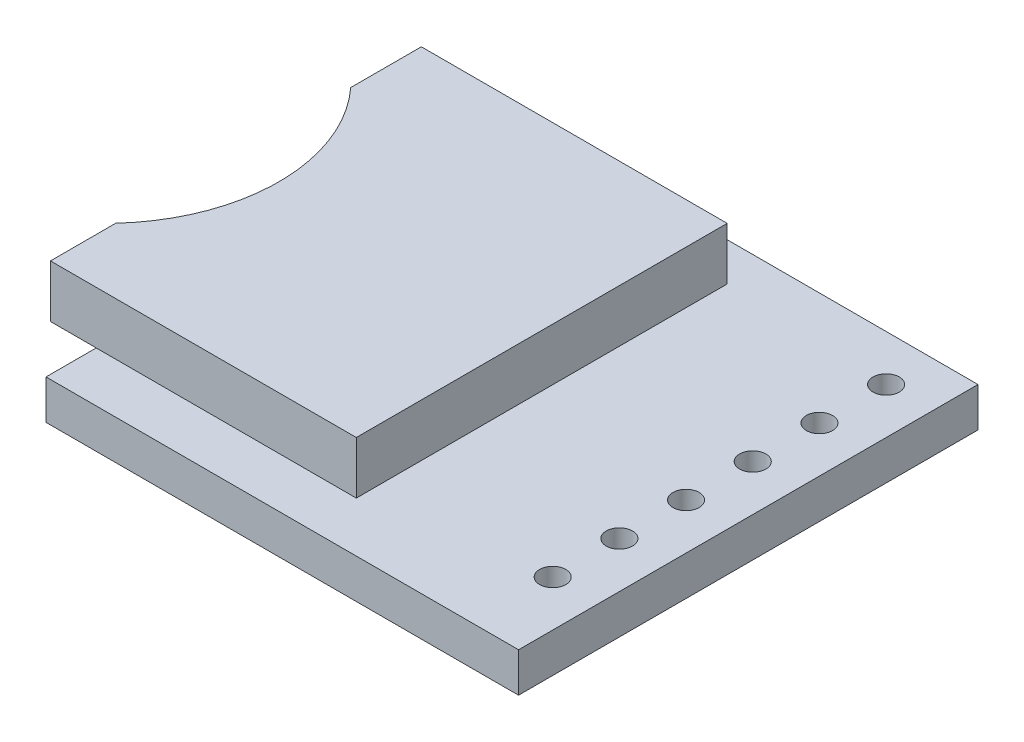
ISO-10303-21;
HEADER;
FILE_DESCRIPTION(('STEP AP214'),'2;1');
FILE_NAME('part.step','',(''),(''),'','','');
FILE_SCHEMA(('AUTOMOTIVE_DESIGN { 1 0 10303 214 1 1 1 1 }'));
ENDSEC;
DATA;
#1=APPLICATION_CONTEXT('core data for automotive mechanical design processes');
#2=APPLICATION_PROTOCOL_DEFINITION('international standard','automotive_design',2000,#1);
#3=PRODUCT_CONTEXT('',#1,'mechanical');
#4=PRODUCT('Part','Part','',(#3));
#5=PRODUCT_RELATED_PRODUCT_CATEGORY('part','',(#4));
#6=PRODUCT_DEFINITION_FORMATION('','',#4);
#7=PRODUCT_DEFINITION_CONTEXT('part definition',#1,'design');
#8=PRODUCT_DEFINITION('design','',#6,#7);
#9=PRODUCT_DEFINITION_SHAPE('','',#8);
#10=(LENGTH_UNIT() NAMED_UNIT(*) SI_UNIT(.MILLI.,.METRE.));
#11=(NAMED_UNIT(*) PLANE_ANGLE_UNIT() SI_UNIT($,.RADIAN.));
#12=(NAMED_UNIT(*) SI_UNIT($,.STERADIAN.) SOLID_ANGLE_UNIT());
#13=UNCERTAINTY_MEASURE_WITH_UNIT(LENGTH_MEASURE(1.E-05),#10,'distance_accuracy_value','');
#14=(GEOMETRIC_REPRESENTATION_CONTEXT(3) GLOBAL_UNCERTAINTY_ASSIGNED_CONTEXT((#13)) GLOBAL_UNIT_ASSIGNED_CONTEXT((#10,
#11,#12)) REPRESENTATION_CONTEXT('',''));
#15=CARTESIAN_POINT('',(0.,0.,0.));
#16=DIRECTION('',(0.,0.,1.));
#17=DIRECTION('',(1.,0.,0.));
#18=AXIS2_PLACEMENT_3D('',#15,#16,#17);
#19=CARTESIAN_POINT('',(-6.62061361407663,3.5,-8.87314717328991));
#20=DIRECTION('',(0.,-1.,0.));
#21=DIRECTION('',(0.,0.,-1.));
#22=AXIS2_PLACEMENT_3D('',#19,#20,#21);
#23=CYLINDRICAL_SURFACE('',#22,6.62061361407663);
#24=DIRECTION('',(0.,-1.,0.));
#25=VECTOR('',#24,1.);
#26=CARTESIAN_POINT('',(-1.74237560385393,3.5,-13.3492301196299));
#27=LINE('',#26,#25);
#28=CARTESIAN_POINT('',(-1.74237560385393,3.5,-13.3492301196299));
#29=VERTEX_POINT('',#28);
#30=CARTESIAN_POINT('',(-1.74237560385393,2.98920449404368,-13.3492301196299));
#31=VERTEX_POINT('',#30);
#32=EDGE_CURVE('E277',#29,#31,#27,.T.);
#33=ORIENTED_EDGE('',*,*,#32,.T.);
#34=CARTESIAN_POINT('',(-6.62061361407663,2.98920449404368,-8.87314717328991));
#35=DIRECTION('',(0.,1.,0.));
#36=DIRECTION('',(0.,0.,1.));
#37=AXIS2_PLACEMENT_3D('',#34,#35,#36);
#38=CIRCLE('',#37,6.62061361407663);
#39=CARTESIAN_POINT('',(-1.74237560385393,2.98920449404368,-4.39706422694996));
#40=VERTEX_POINT('',#39);
#41=EDGE_CURVE('E199',#31,#40,#38,.F.);
#42=ORIENTED_EDGE('',*,*,#41,.T.);
#43=DIRECTION('',(0.,-1.,0.));
#44=VECTOR('',#43,1.);
#45=CARTESIAN_POINT('',(-1.74237560385393,3.5,-4.39706422694997));
#46=LINE('',#45,#44);
#47=CARTESIAN_POINT('',(-1.74237560385393,3.5,-4.39706422694997));
#48=VERTEX_POINT('',#47);
#49=EDGE_CURVE('E274',#48,#40,#46,.T.);
#50=ORIENTED_EDGE('',*,*,#49,.F.);
#51=CARTESIAN_POINT('',(-6.62061361407663,3.5,-8.87314717328991));
#52=DIRECTION('',(0.,-1.,0.));
#53=DIRECTION('',(0.,0.,-1.));
#54=AXIS2_PLACEMENT_3D('',#51,#52,#53);
#55=CIRCLE('',#54,6.62061361407663);
#56=EDGE_CURVE('E246',#29,#48,#55,.T.);
#57=ORIENTED_EDGE('',*,*,#56,.F.);
#58=EDGE_LOOP('',(#33,#42,#50,#57));
#59=FACE_BOUND('',#58,.T.);
#60=ADVANCED_FACE('F37',(#59),#23,.F.);
#61=CARTESIAN_POINT('',(0.,1.5,0.));
#62=DIRECTION('',(0.,-1.,0.));
#63=DIRECTION('',(0.,0.,-1.));
#64=AXIS2_PLACEMENT_3D('',#61,#62,#63);
#65=PLANE('',#64);
#66=CARTESIAN_POINT('',(16.25,1.5,-13.21));
#67=DIRECTION('',(0.,1.,0.));
#68=DIRECTION('',(0.,0.,1.));
#69=AXIS2_PLACEMENT_3D('',#66,#67,#68);
#70=CIRCLE('',#69,0.499999999999999);
#71=CARTESIAN_POINT('',(16.25,1.5,-12.71));
#72=VERTEX_POINT('',#71);
#73=EDGE_CURVE('E207',#72,#72,#70,.T.);
#74=ORIENTED_EDGE('',*,*,#73,.F.);
#75=EDGE_LOOP('',(#74));
#76=FACE_BOUND('',#75,.T.);
#77=CARTESIAN_POINT('',(16.25,1.5,-10.67));
#78=DIRECTION('',(0.,1.,0.));
#79=DIRECTION('',(0.,0.,1.));
#80=AXIS2_PLACEMENT_3D('',#77,#78,#79);
#81=CIRCLE('',#80,0.499999999999999);
#82=CARTESIAN_POINT('',(16.25,1.5,-10.17));
#83=VERTEX_POINT('',#82);
#84=EDGE_CURVE('E213',#83,#83,#81,.T.);
#85=ORIENTED_EDGE('',*,*,#84,.F.);
#86=EDGE_LOOP('',(#85));
#87=FACE_BOUND('',#86,.T.);
#88=CARTESIAN_POINT('',(16.2500000000001,1.5,-8.13));
#89=DIRECTION('',(0.,1.,0.));
#90=DIRECTION('',(0.,0.,1.));
#91=AXIS2_PLACEMENT_3D('',#88,#89,#90);
#92=CIRCLE('',#91,0.499999999999999);
#93=CARTESIAN_POINT('',(16.2500000000001,1.5,-7.63));
#94=VERTEX_POINT('',#93);
#95=EDGE_CURVE('E219',#94,#94,#92,.T.);
#96=ORIENTED_EDGE('',*,*,#95,.F.);
#97=EDGE_LOOP('',(#96));
#98=FACE_BOUND('',#97,.T.);
#99=CARTESIAN_POINT('',(16.2500000000001,1.5,-5.59));
#100=DIRECTION('',(0.,1.,0.));
#101=DIRECTION('',(0.,0.,1.));
#102=AXIS2_PLACEMENT_3D('',#99,#100,#101);
#103=CIRCLE('',#102,0.499999999999999);
#104=CARTESIAN_POINT('',(16.2500000000001,1.5,-5.09));
#105=VERTEX_POINT('',#104);
#106=EDGE_CURVE('E225',#105,#105,#103,.T.);
#107=ORIENTED_EDGE('',*,*,#106,.F.);
#108=EDGE_LOOP('',(#107));
#109=FACE_BOUND('',#108,.T.);
#110=CARTESIAN_POINT('',(16.2500000000001,1.5,-3.05));
#111=DIRECTION('',(0.,1.,0.));
#112=DIRECTION('',(0.,0.,1.));
#113=AXIS2_PLACEMENT_3D('',#110,#111,#112);
#114=CIRCLE('',#113,0.499999999999999);
#115=CARTESIAN_POINT('',(16.2500000000001,1.5,-2.55));
#116=VERTEX_POINT('',#115);
#117=EDGE_CURVE('E202',#116,#116,#114,.T.);
#118=ORIENTED_EDGE('',*,*,#117,.F.);
#119=EDGE_LOOP('',(#118));
#120=FACE_BOUND('',#119,.T.);
#121=CARTESIAN_POINT('',(16.25,1.5,-15.75));
#122=DIRECTION('',(0.,1.,0.));
#123=DIRECTION('',(0.,0.,1.));
#124=AXIS2_PLACEMENT_3D('',#121,#122,#123);
#125=CIRCLE('',#124,0.499999999999999);
#126=CARTESIAN_POINT('',(16.25,1.5,-15.25));
#127=VERTEX_POINT('',#126);
#128=EDGE_CURVE('E206',#127,#127,#125,.T.);
#129=ORIENTED_EDGE('',*,*,#128,.F.);
#130=EDGE_LOOP('',(#129));
#131=FACE_BOUND('',#130,.T.);
#132=DIRECTION('',(1.,0.,0.));
#133=VECTOR('',#132,1.);
#134=CARTESIAN_POINT('',(9.9072621475198,1.5,-1.91222403222469));
#135=LINE('',#134,#133);
#136=CARTESIAN_POINT('',(0.,1.5,-1.91222403222469));
#137=VERTEX_POINT('',#136);
#138=CARTESIAN_POINT('',(9.9072621475198,1.5,-1.91222403222469));
#139=VERTEX_POINT('',#138);
#140=EDGE_CURVE('E45',#137,#139,#135,.T.);
#141=ORIENTED_EDGE('',*,*,#140,.F.);
#142=DIRECTION('',(0.,0.,1.));
#143=VECTOR('',#142,1.);
#144=CARTESIAN_POINT('',(0.,1.5,-17.5));
#145=LINE('',#144,#143);
#146=CARTESIAN_POINT('',(0.,1.5,0.));
#147=VERTEX_POINT('',#146);
#148=EDGE_CURVE('E293',#137,#147,#145,.T.);
#149=ORIENTED_EDGE('',*,*,#148,.T.);
#150=DIRECTION('',(1.,0.,0.));
#151=VECTOR('',#150,1.);
#152=CARTESIAN_POINT('',(18.,1.5,0.));
#153=LINE('',#152,#151);
#154=CARTESIAN_POINT('',(18.,1.5,0.));
#155=VERTEX_POINT('',#154);
#156=EDGE_CURVE('E296',#147,#155,#153,.T.);
#157=ORIENTED_EDGE('',*,*,#156,.T.);
#158=DIRECTION('',(0.,0.,-1.));
#159=VECTOR('',#158,1.);
#160=CARTESIAN_POINT('',(18.,1.5,-17.5));
#161=LINE('',#160,#159);
#162=CARTESIAN_POINT('',(18.,1.5,-17.5));
#163=VERTEX_POINT('',#162);
#164=EDGE_CURVE('E287',#155,#163,#161,.T.);
#165=ORIENTED_EDGE('',*,*,#164,.T.);
#166=DIRECTION('',(-1.,0.,0.));
#167=VECTOR('',#166,1.);
#168=CARTESIAN_POINT('',(18.,1.5,-17.5));
#169=LINE('',#168,#167);
#170=CARTESIAN_POINT('',(0.,1.5,-17.5));
#171=VERTEX_POINT('',#170);
#172=EDGE_CURVE('E290',#163,#171,#169,.T.);
#173=ORIENTED_EDGE('',*,*,#172,.T.);
#174=CARTESIAN_POINT('',(0.,1.5,-16.0392866016821));
#175=VERTEX_POINT('',#174);
#176=EDGE_CURVE('E294',#171,#175,#145,.T.);
#177=ORIENTED_EDGE('',*,*,#176,.T.);
#178=DIRECTION('',(-1.,0.,0.));
#179=VECTOR('',#178,1.);
#180=CARTESIAN_POINT('',(9.9072621475198,1.5,-16.0392866016821));
#181=LINE('',#180,#179);
#182=CARTESIAN_POINT('',(9.9072621475198,1.5,-16.0392866016821));
#183=VERTEX_POINT('',#182);
#184=EDGE_CURVE('E255',#183,#175,#181,.T.);
#185=ORIENTED_EDGE('',*,*,#184,.F.);
#186=DIRECTION('',(0.,0.,-1.));
#187=VECTOR('',#186,1.);
#188=CARTESIAN_POINT('',(9.9072621475198,1.5,-16.0392866016821));
#189=LINE('',#188,#187);
#190=EDGE_CURVE('E59',#139,#183,#189,.T.);
#191=ORIENTED_EDGE('',*,*,#190,.F.);
#192=EDGE_LOOP('',(#141,#149,#157,#165,#173,#177,#185,#191));
#193=FACE_BOUND('',#192,.T.);
#194=ADVANCED_FACE('F345',(#76,#87,#98,#109,#120,#131,#193),#65,.F.);
#195=CARTESIAN_POINT('',(18.,1.5,-17.5));
#196=DIRECTION('',(-1.,0.,0.));
#197=DIRECTION('',(0.,0.,1.));
#198=AXIS2_PLACEMENT_3D('',#195,#196,#197);
#199=PLANE('',#198);
#200=DIRECTION('',(0.,0.,-1.));
#201=VECTOR('',#200,1.);
#202=CARTESIAN_POINT('',(18.,0.,-17.5));
#203=LINE('',#202,#201);
#204=CARTESIAN_POINT('',(18.,0.,0.));
#205=VERTEX_POINT('',#204);
#206=CARTESIAN_POINT('',(18.,0.,-17.5));
#207=VERTEX_POINT('',#206);
#208=EDGE_CURVE('E286',#205,#207,#203,.T.);
#209=ORIENTED_EDGE('',*,*,#208,.T.);
#210=DIRECTION('',(0.,-1.,0.));
#211=VECTOR('',#210,1.);
#212=CARTESIAN_POINT('',(18.,1.5,-17.5));
#213=LINE('',#212,#211);
#214=EDGE_CURVE('E314',#163,#207,#213,.T.);
#215=ORIENTED_EDGE('',*,*,#214,.F.);
#216=ORIENTED_EDGE('',*,*,#164,.F.);
#217=DIRECTION('',(0.,-1.,0.));
#218=VECTOR('',#217,1.);
#219=CARTESIAN_POINT('',(18.,1.5,0.));
#220=LINE('',#219,#218);
#221=EDGE_CURVE('E299',#155,#205,#220,.T.);
#222=ORIENTED_EDGE('',*,*,#221,.T.);
#223=EDGE_LOOP('',(#209,#215,#216,#222));
#224=FACE_BOUND('',#223,.T.);
#225=ADVANCED_FACE('F39',(#224),#199,.F.);
#226=CARTESIAN_POINT('',(18.,1.5,-17.5));
#227=DIRECTION('',(0.,0.,1.));
#228=DIRECTION('',(1.,0.,0.));
#229=AXIS2_PLACEMENT_3D('',#226,#227,#228);
#230=PLANE('',#229);
#231=DIRECTION('',(-1.,0.,0.));
#232=VECTOR('',#231,1.);
#233=CARTESIAN_POINT('',(18.,0.,-17.5));
#234=LINE('',#233,#232);
#235=CARTESIAN_POINT('',(0.,0.,-17.5));
#236=VERTEX_POINT('',#235);
#237=EDGE_CURVE('E302',#207,#236,#234,.T.);
#238=ORIENTED_EDGE('',*,*,#237,.T.);
#239=DIRECTION('',(0.,-1.,0.));
#240=VECTOR('',#239,1.);
#241=CARTESIAN_POINT('',(0.,1.5,-17.5));
#242=LINE('',#241,#240);
#243=EDGE_CURVE('E312',#171,#236,#242,.T.);
#244=ORIENTED_EDGE('',*,*,#243,.F.);
#245=ORIENTED_EDGE('',*,*,#172,.F.);
#246=ORIENTED_EDGE('',*,*,#214,.T.);
#247=EDGE_LOOP('',(#238,#244,#245,#246));
#248=FACE_BOUND('',#247,.T.);
#249=ADVANCED_FACE('F358',(#248),#230,.F.);
#250=CARTESIAN_POINT('',(0.,1.5,-17.5));
#251=DIRECTION('',(1.,0.,0.));
#252=DIRECTION('',(0.,0.,-1.));
#253=AXIS2_PLACEMENT_3D('',#250,#251,#252);
#254=PLANE('',#253);
#255=DIRECTION('',(0.,0.,1.));
#256=VECTOR('',#255,1.);
#257=CARTESIAN_POINT('',(0.,0.,-17.5));
#258=LINE('',#257,#256);
#259=CARTESIAN_POINT('',(0.,0.,0.));
#260=VERTEX_POINT('',#259);
#261=EDGE_CURVE('E304',#236,#260,#258,.T.);
#262=ORIENTED_EDGE('',*,*,#261,.T.);
#263=DIRECTION('',(0.,-1.,0.));
#264=VECTOR('',#263,1.);
#265=CARTESIAN_POINT('',(0.,1.5,0.));
#266=LINE('',#265,#264);
#267=EDGE_CURVE('E309',#147,#260,#266,.T.);
#268=ORIENTED_EDGE('',*,*,#267,.F.);
#269=ORIENTED_EDGE('',*,*,#148,.F.);
#270=CARTESIAN_POINT('',(0.,1.5,-8.87314717328991));
#271=VERTEX_POINT('',#270);
#272=EDGE_CURVE('E339',#271,#137,#145,.T.);
#273=ORIENTED_EDGE('',*,*,#272,.F.);
#274=EDGE_CURVE('E297',#175,#271,#145,.T.);
#275=ORIENTED_EDGE('',*,*,#274,.F.);
#276=ORIENTED_EDGE('',*,*,#176,.F.);
#277=ORIENTED_EDGE('',*,*,#243,.T.);
#278=EDGE_LOOP('',(#262,#268,#269,#273,#275,#276,#277));
#279=FACE_BOUND('',#278,.T.);
#280=ADVANCED_FACE('F348',(#279),#254,.F.);
#281=CARTESIAN_POINT('',(18.,1.5,0.));
#282=DIRECTION('',(0.,0.,-1.));
#283=DIRECTION('',(-1.,0.,0.));
#284=AXIS2_PLACEMENT_3D('',#281,#282,#283);
#285=PLANE('',#284);
#286=DIRECTION('',(1.,0.,0.));
#287=VECTOR('',#286,1.);
#288=CARTESIAN_POINT('',(18.,0.,0.));
#289=LINE('',#288,#287);
#290=EDGE_CURVE('E291',#260,#205,#289,.T.);
#291=ORIENTED_EDGE('',*,*,#290,.T.);
#292=ORIENTED_EDGE('',*,*,#221,.F.);
#293=ORIENTED_EDGE('',*,*,#156,.F.);
#294=ORIENTED_EDGE('',*,*,#267,.T.);
#295=EDGE_LOOP('',(#291,#292,#293,#294));
#296=FACE_BOUND('',#295,.T.);
#297=ADVANCED_FACE('F352',(#296),#285,.F.);
#298=CARTESIAN_POINT('',(0.,0.,0.));
#299=DIRECTION('',(0.,-1.,0.));
#300=DIRECTION('',(0.,0.,-1.));
#301=AXIS2_PLACEMENT_3D('',#298,#299,#300);
#302=PLANE('',#301);
#303=CARTESIAN_POINT('',(16.25,0.,-13.21));
#304=DIRECTION('',(0.,1.,0.));
#305=DIRECTION('',(0.,0.,1.));
#306=AXIS2_PLACEMENT_3D('',#303,#304,#305);
#307=CIRCLE('',#306,0.499999999999999);
#308=CARTESIAN_POINT('',(16.25,0.,-12.71));
#309=VERTEX_POINT('',#308);
#310=EDGE_CURVE('E203',#309,#309,#307,.T.);
#311=ORIENTED_EDGE('',*,*,#310,.T.);
#312=EDGE_LOOP('',(#311));
#313=FACE_BOUND('',#312,.T.);
#314=CARTESIAN_POINT('',(16.25,0.,-10.67));
#315=DIRECTION('',(0.,1.,0.));
#316=DIRECTION('',(0.,0.,1.));
#317=AXIS2_PLACEMENT_3D('',#314,#315,#316);
#318=CIRCLE('',#317,0.499999999999999);
#319=CARTESIAN_POINT('',(16.25,0.,-10.17));
#320=VERTEX_POINT('',#319);
#321=EDGE_CURVE('E210',#320,#320,#318,.T.);
#322=ORIENTED_EDGE('',*,*,#321,.T.);
#323=EDGE_LOOP('',(#322));
#324=FACE_BOUND('',#323,.T.);
#325=CARTESIAN_POINT('',(16.2500000000001,0.,-8.13));
#326=DIRECTION('',(0.,1.,0.));
#327=DIRECTION('',(0.,0.,1.));
#328=AXIS2_PLACEMENT_3D('',#325,#326,#327);
#329=CIRCLE('',#328,0.499999999999999);
#330=CARTESIAN_POINT('',(16.2500000000001,0.,-7.63));
#331=VERTEX_POINT('',#330);
#332=EDGE_CURVE('E216',#331,#331,#329,.T.);
#333=ORIENTED_EDGE('',*,*,#332,.T.);
#334=EDGE_LOOP('',(#333));
#335=FACE_BOUND('',#334,.T.);
#336=CARTESIAN_POINT('',(16.2500000000001,0.,-5.59));
#337=DIRECTION('',(0.,1.,0.));
#338=DIRECTION('',(0.,0.,1.));
#339=AXIS2_PLACEMENT_3D('',#336,#337,#338);
#340=CIRCLE('',#339,0.499999999999999);
#341=CARTESIAN_POINT('',(16.2500000000001,0.,-5.09));
#342=VERTEX_POINT('',#341);
#343=EDGE_CURVE('E222',#342,#342,#340,.T.);
#344=ORIENTED_EDGE('',*,*,#343,.T.);
#345=EDGE_LOOP('',(#344));
#346=FACE_BOUND('',#345,.T.);
#347=CARTESIAN_POINT('',(16.2500000000001,0.,-3.05));
#348=DIRECTION('',(0.,1.,0.));
#349=DIRECTION('',(0.,0.,1.));
#350=AXIS2_PLACEMENT_3D('',#347,#348,#349);
#351=CIRCLE('',#350,0.499999999999999);
#352=CARTESIAN_POINT('',(16.2500000000001,0.,-2.55));
#353=VERTEX_POINT('',#352);
#354=EDGE_CURVE('E228',#353,#353,#351,.T.);
#355=ORIENTED_EDGE('',*,*,#354,.T.);
#356=EDGE_LOOP('',(#355));
#357=FACE_BOUND('',#356,.T.);
#358=CARTESIAN_POINT('',(16.25,0.,-15.75));
#359=DIRECTION('',(0.,1.,0.));
#360=DIRECTION('',(0.,0.,1.));
#361=AXIS2_PLACEMENT_3D('',#358,#359,#360);
#362=CIRCLE('',#361,0.499999999999999);
#363=CARTESIAN_POINT('',(16.25,0.,-15.25));
#364=VERTEX_POINT('',#363);
#365=EDGE_CURVE('E233',#364,#364,#362,.T.);
#366=ORIENTED_EDGE('',*,*,#365,.T.);
#367=EDGE_LOOP('',(#366));
#368=FACE_BOUND('',#367,.T.);
#369=ORIENTED_EDGE('',*,*,#208,.F.);
#370=ORIENTED_EDGE('',*,*,#290,.F.);
#371=ORIENTED_EDGE('',*,*,#261,.F.);
#372=ORIENTED_EDGE('',*,*,#237,.F.);
#373=EDGE_LOOP('',(#369,#370,#371,#372));
#374=FACE_BOUND('',#373,.T.);
#375=ADVANCED_FACE('F396',(#313,#324,#335,#346,#357,#368,#374),#302,.T.);
#376=CARTESIAN_POINT('',(-6.62061361407663,1.5,-8.87314717328991));
#377=DIRECTION('',(0.,-1.,0.));
#378=DIRECTION('',(0.,0.,-1.));
#379=AXIS2_PLACEMENT_3D('',#376,#377,#378);
#380=PLANE('',#379);
#381=CARTESIAN_POINT('',(-1.74237560385393,1.5,-16.0392866016821));
#382=VERTEX_POINT('',#381);
#383=EDGE_CURVE('E254',#175,#382,#181,.T.);
#384=ORIENTED_EDGE('',*,*,#383,.F.);
#385=ORIENTED_EDGE('',*,*,#274,.T.);
#386=CARTESIAN_POINT('',(-6.62061361407663,1.5,-8.87314717328991));
#387=DIRECTION('',(0.,-1.,0.));
#388=DIRECTION('',(0.,0.,-1.));
#389=AXIS2_PLACEMENT_3D('',#386,#387,#388);
#390=CIRCLE('',#389,6.62061361407663);
#391=CARTESIAN_POINT('',(-1.74237560385393,1.5,-13.3492301196299));
#392=VERTEX_POINT('',#391);
#393=EDGE_CURVE('E261',#392,#271,#390,.T.);
#394=ORIENTED_EDGE('',*,*,#393,.F.);
#395=DIRECTION('',(0.,0.,1.));
#396=VECTOR('',#395,1.);
#397=CARTESIAN_POINT('',(-1.74237560385393,1.5,-16.0392866016821));
#398=LINE('',#397,#396);
#399=EDGE_CURVE('E258',#382,#392,#398,.T.);
#400=ORIENTED_EDGE('',*,*,#399,.F.);
#401=EDGE_LOOP('',(#384,#385,#394,#400));
#402=FACE_BOUND('',#401,.T.);
#403=ADVANCED_FACE('F363',(#402),#380,.T.);
#404=CARTESIAN_POINT('',(9.9072621475198,3.5,-16.0392866016821));
#405=DIRECTION('',(-1.,0.,0.));
#406=DIRECTION('',(0.,0.,1.));
#407=AXIS2_PLACEMENT_3D('',#404,#405,#406);
#408=PLANE('',#407);
#409=ORIENTED_EDGE('',*,*,#190,.T.);
#410=DIRECTION('',(0.,-1.,0.));
#411=VECTOR('',#410,1.);
#412=CARTESIAN_POINT('',(9.9072621475198,3.5,-16.0392866016821));
#413=LINE('',#412,#411);
#414=CARTESIAN_POINT('',(9.9072621475198,3.5,-16.0392866016821));
#415=VERTEX_POINT('',#414);
#416=EDGE_CURVE('E283',#415,#183,#413,.T.);
#417=ORIENTED_EDGE('',*,*,#416,.F.);
#418=DIRECTION('',(0.,0.,-1.));
#419=VECTOR('',#418,1.);
#420=CARTESIAN_POINT('',(9.9072621475198,3.5,-16.0392866016821));
#421=LINE('',#420,#419);
#422=CARTESIAN_POINT('',(9.9072621475198,3.5,-1.91222403222469));
#423=VERTEX_POINT('',#422);
#424=EDGE_CURVE('E238',#423,#415,#421,.T.);
#425=ORIENTED_EDGE('',*,*,#424,.F.);
#426=DIRECTION('',(0.,-1.,0.));
#427=VECTOR('',#426,1.);
#428=CARTESIAN_POINT('',(9.9072621475198,3.5,-1.91222403222469));
#429=LINE('',#428,#427);
#430=EDGE_CURVE('E252',#423,#139,#429,.T.);
#431=ORIENTED_EDGE('',*,*,#430,.T.);
#432=EDGE_LOOP('',(#409,#417,#425,#431));
#433=FACE_BOUND('',#432,.T.);
#434=ADVANCED_FACE('F326',(#433),#408,.F.);
#435=CARTESIAN_POINT('',(9.9072621475198,3.5,-16.0392866016821));
#436=DIRECTION('',(0.,0.,1.));
#437=DIRECTION('',(1.,0.,0.));
#438=AXIS2_PLACEMENT_3D('',#435,#436,#437);
#439=PLANE('',#438);
#440=ORIENTED_EDGE('',*,*,#184,.T.);
#441=ORIENTED_EDGE('',*,*,#383,.T.);
#442=DIRECTION('',(0.,-1.,0.));
#443=VECTOR('',#442,1.);
#444=CARTESIAN_POINT('',(-1.74237560385393,3.5,-16.0392866016821));
#445=LINE('',#444,#443);
#446=CARTESIAN_POINT('',(-1.74237560385393,3.5,-16.0392866016821));
#447=VERTEX_POINT('',#446);
#448=EDGE_CURVE('E280',#447,#382,#445,.T.);
#449=ORIENTED_EDGE('',*,*,#448,.F.);
#450=DIRECTION('',(-1.,0.,0.));
#451=VECTOR('',#450,1.);
#452=CARTESIAN_POINT('',(9.9072621475198,3.5,-16.0392866016821));
#453=LINE('',#452,#451);
#454=EDGE_CURVE('E241',#415,#447,#453,.T.);
#455=ORIENTED_EDGE('',*,*,#454,.F.);
#456=ORIENTED_EDGE('',*,*,#416,.T.);
#457=EDGE_LOOP('',(#440,#441,#449,#455,#456));
#458=FACE_BOUND('',#457,.T.);
#459=ADVANCED_FACE('F365',(#458),#439,.F.);
#460=CARTESIAN_POINT('',(-1.74237560385393,3.5,-16.0392866016821));
#461=DIRECTION('',(1.,0.,0.));
#462=DIRECTION('',(0.,0.,-1.));
#463=AXIS2_PLACEMENT_3D('',#460,#461,#462);
#464=PLANE('',#463);
#465=DIRECTION('',(0.,-1.,0.));
#466=VECTOR('',#465,1.);
#467=CARTESIAN_POINT('',(-1.74237560385393,2.98920449404368,-14.5044668459036));
#468=LINE('',#467,#466);
#469=CARTESIAN_POINT('',(-1.74237560385393,2.98920449404368,-14.5044668459036));
#470=VERTEX_POINT('',#469);
#471=CARTESIAN_POINT('',(-1.74237560385393,2.02063086651534,-14.5044668459036));
#472=VERTEX_POINT('',#471);
#473=EDGE_CURVE('E171',#470,#472,#468,.T.);
#474=ORIENTED_EDGE('',*,*,#473,.F.);
#475=DIRECTION('',(0.,0.,-1.));
#476=VECTOR('',#475,1.);
#477=CARTESIAN_POINT('',(-1.74237560385393,2.98920449404368,-14.5044668459036));
#478=LINE('',#477,#476);
#479=EDGE_CURVE('E185',#31,#470,#478,.T.);
#480=ORIENTED_EDGE('',*,*,#479,.F.);
#481=ORIENTED_EDGE('',*,*,#32,.F.);
#482=DIRECTION('',(0.,0.,1.));
#483=VECTOR('',#482,1.);
#484=CARTESIAN_POINT('',(-1.74237560385393,3.5,-16.0392866016821));
#485=LINE('',#484,#483);
#486=EDGE_CURVE('E244',#447,#29,#485,.T.);
#487=ORIENTED_EDGE('',*,*,#486,.F.);
#488=ORIENTED_EDGE('',*,*,#448,.T.);
#489=ORIENTED_EDGE('',*,*,#399,.T.);
#490=CARTESIAN_POINT('',(-1.74237560385393,2.02063086651534,-13.3492301196299));
#491=VERTEX_POINT('',#490);
#492=EDGE_CURVE('E181',#491,#392,#27,.T.);
#493=ORIENTED_EDGE('',*,*,#492,.F.);
#494=DIRECTION('',(0.,0.,1.));
#495=VECTOR('',#494,1.);
#496=CARTESIAN_POINT('',(-1.74237560385393,2.02063086651534,-14.5044668459036));
#497=LINE('',#496,#495);
#498=EDGE_CURVE('E160',#472,#491,#497,.T.);
#499=ORIENTED_EDGE('',*,*,#498,.F.);
#500=EDGE_LOOP('',(#474,#480,#481,#487,#488,#489,#493,#499));
#501=FACE_BOUND('',#500,.T.);
#502=ADVANCED_FACE('F179',(#501),#464,.F.);
#503=CARTESIAN_POINT('',(-1.74237560385393,2.02063086651534,-4.39706422694997));
#504=VERTEX_POINT('',#503);
#505=CARTESIAN_POINT('',(-1.74237560385393,1.5,-4.39706422694997));
#506=VERTEX_POINT('',#505);
#507=EDGE_CURVE('E273',#504,#506,#46,.T.);
#508=ORIENTED_EDGE('',*,*,#507,.F.);
#509=CARTESIAN_POINT('',(-6.62061361407663,2.02063086651534,-8.87314717328991));
#510=DIRECTION('',(0.,-1.,0.));
#511=DIRECTION('',(0.,0.,-1.));
#512=AXIS2_PLACEMENT_3D('',#509,#510,#511);
#513=CIRCLE('',#512,6.62061361407663);
#514=EDGE_CURVE('E52',#504,#491,#513,.F.);
#515=ORIENTED_EDGE('',*,*,#514,.T.);
#516=ORIENTED_EDGE('',*,*,#492,.T.);
#517=ORIENTED_EDGE('',*,*,#393,.T.);
#518=EDGE_CURVE('E260',#271,#506,#390,.T.);
#519=ORIENTED_EDGE('',*,*,#518,.T.);
#520=EDGE_LOOP('',(#508,#515,#516,#517,#519));
#521=FACE_BOUND('',#520,.T.);
#522=ADVANCED_FACE('F374',(#521),#23,.F.);
#523=CARTESIAN_POINT('',(-1.74237560385393,3.5,-4.39706422694996));
#524=DIRECTION('',(1.,0.,0.));
#525=DIRECTION('',(0.,0.,-1.));
#526=AXIS2_PLACEMENT_3D('',#523,#524,#525);
#527=PLANE('',#526);
#528=ORIENTED_EDGE('',*,*,#49,.T.);
#529=CARTESIAN_POINT('',(-1.74237560385393,2.98920449404368,-3.05250807336271));
#530=VERTEX_POINT('',#529);
#531=EDGE_CURVE('E167',#530,#40,#478,.T.);
#532=ORIENTED_EDGE('',*,*,#531,.F.);
#533=DIRECTION('',(0.,1.,0.));
#534=VECTOR('',#533,1.);
#535=CARTESIAN_POINT('',(-1.74237560385393,2.98920449404368,-3.05250807336271));
#536=LINE('',#535,#534);
#537=CARTESIAN_POINT('',(-1.74237560385393,2.02063086651534,-3.05250807336271));
#538=VERTEX_POINT('',#537);
#539=EDGE_CURVE('E182',#538,#530,#536,.T.);
#540=ORIENTED_EDGE('',*,*,#539,.F.);
#541=DIRECTION('',(0.,0.,-1.));
#542=VECTOR('',#541,1.);
#543=CARTESIAN_POINT('',(-1.74237560385393,2.02063086651534,-4.39706422694996));
#544=LINE('',#543,#542);
#545=EDGE_CURVE('E12',#538,#504,#544,.T.);
#546=ORIENTED_EDGE('',*,*,#545,.T.);
#547=ORIENTED_EDGE('',*,*,#507,.T.);
#548=DIRECTION('',(0.,0.,1.));
#549=VECTOR('',#548,1.);
#550=CARTESIAN_POINT('',(-1.74237560385393,1.5,-4.39706422694996));
#551=LINE('',#550,#549);
#552=CARTESIAN_POINT('',(-1.74237560385393,1.5,-1.91222403222469));
#553=VERTEX_POINT('',#552);
#554=EDGE_CURVE('E264',#506,#553,#551,.T.);
#555=ORIENTED_EDGE('',*,*,#554,.T.);
#556=DIRECTION('',(0.,-1.,0.));
#557=VECTOR('',#556,1.);
#558=CARTESIAN_POINT('',(-1.74237560385393,3.5,-1.91222403222469));
#559=LINE('',#558,#557);
#560=CARTESIAN_POINT('',(-1.74237560385393,3.5,-1.91222403222469));
#561=VERTEX_POINT('',#560);
#562=EDGE_CURVE('E270',#561,#553,#559,.T.);
#563=ORIENTED_EDGE('',*,*,#562,.F.);
#564=DIRECTION('',(0.,0.,1.));
#565=VECTOR('',#564,1.);
#566=CARTESIAN_POINT('',(-1.74237560385393,3.5,-4.39706422694996));
#567=LINE('',#566,#565);
#568=EDGE_CURVE('E248',#48,#561,#567,.T.);
#569=ORIENTED_EDGE('',*,*,#568,.F.);
#570=EDGE_LOOP('',(#528,#532,#540,#546,#547,#555,#563,#569));
#571=FACE_BOUND('',#570,.T.);
#572=ADVANCED_FACE('F372',(#571),#527,.F.);
#573=CARTESIAN_POINT('',(9.9072621475198,3.5,-1.91222403222469));
#574=DIRECTION('',(0.,0.,-1.));
#575=DIRECTION('',(-1.,0.,0.));
#576=AXIS2_PLACEMENT_3D('',#573,#574,#575);
#577=PLANE('',#576);
#578=EDGE_CURVE('E242',#553,#137,#135,.T.);
#579=ORIENTED_EDGE('',*,*,#578,.T.);
#580=ORIENTED_EDGE('',*,*,#140,.T.);
#581=ORIENTED_EDGE('',*,*,#430,.F.);
#582=DIRECTION('',(1.,0.,0.));
#583=VECTOR('',#582,1.);
#584=CARTESIAN_POINT('',(9.9072621475198,3.5,-1.91222403222469));
#585=LINE('',#584,#583);
#586=EDGE_CURVE('E250',#561,#423,#585,.T.);
#587=ORIENTED_EDGE('',*,*,#586,.F.);
#588=ORIENTED_EDGE('',*,*,#562,.T.);
#589=EDGE_LOOP('',(#579,#580,#581,#587,#588));
#590=FACE_BOUND('',#589,.T.);
#591=ADVANCED_FACE('F320',(#590),#577,.F.);
#592=CARTESIAN_POINT('',(-6.62061361407663,3.5,-8.87314717328991));
#593=DIRECTION('',(0.,-1.,0.));
#594=DIRECTION('',(0.,0.,-1.));
#595=AXIS2_PLACEMENT_3D('',#592,#593,#594);
#596=PLANE('',#595);
#597=ORIENTED_EDGE('',*,*,#424,.T.);
#598=ORIENTED_EDGE('',*,*,#454,.T.);
#599=ORIENTED_EDGE('',*,*,#486,.T.);
#600=ORIENTED_EDGE('',*,*,#56,.T.);
#601=ORIENTED_EDGE('',*,*,#568,.T.);
#602=ORIENTED_EDGE('',*,*,#586,.T.);
#603=EDGE_LOOP('',(#597,#598,#599,#600,#601,#602));
#604=FACE_BOUND('',#603,.T.);
#605=ADVANCED_FACE('F329',(#604),#596,.F.);
#606=ORIENTED_EDGE('',*,*,#518,.F.);
#607=ORIENTED_EDGE('',*,*,#272,.T.);
#608=ORIENTED_EDGE('',*,*,#578,.F.);
#609=ORIENTED_EDGE('',*,*,#554,.F.);
#610=EDGE_LOOP('',(#606,#607,#608,#609));
#611=FACE_BOUND('',#610,.T.);
#612=ADVANCED_FACE('F338',(#611),#380,.T.);
#613=CARTESIAN_POINT('',(16.25,0.,-15.75));
#614=DIRECTION('',(0.,1.,0.));
#615=DIRECTION('',(0.,0.,1.));
#616=AXIS2_PLACEMENT_3D('',#613,#614,#615);
#617=CYLINDRICAL_SURFACE('',#616,0.499999999999999);
#618=ORIENTED_EDGE('',*,*,#365,.F.);
#619=EDGE_LOOP('',(#618));
#620=FACE_BOUND('',#619,.T.);
#621=ORIENTED_EDGE('',*,*,#128,.T.);
#622=EDGE_LOOP('',(#621));
#623=FACE_BOUND('',#622,.T.);
#624=ADVANCED_FACE('F431',(#620,#623),#617,.F.);
#625=CARTESIAN_POINT('',(16.2500000000001,0.,-3.05));
#626=DIRECTION('',(0.,1.,0.));
#627=DIRECTION('',(0.,0.,1.));
#628=AXIS2_PLACEMENT_3D('',#625,#626,#627);
#629=CYLINDRICAL_SURFACE('',#628,0.499999999999999);
#630=ORIENTED_EDGE('',*,*,#354,.F.);
#631=EDGE_LOOP('',(#630));
#632=FACE_BOUND('',#631,.T.);
#633=ORIENTED_EDGE('',*,*,#117,.T.);
#634=EDGE_LOOP('',(#633));
#635=FACE_BOUND('',#634,.T.);
#636=ADVANCED_FACE('F436',(#632,#635),#629,.F.);
#637=CARTESIAN_POINT('',(16.2500000000001,0.,-5.59));
#638=DIRECTION('',(0.,1.,0.));
#639=DIRECTION('',(0.,0.,1.));
#640=AXIS2_PLACEMENT_3D('',#637,#638,#639);
#641=CYLINDRICAL_SURFACE('',#640,0.499999999999999);
#642=ORIENTED_EDGE('',*,*,#343,.F.);
#643=EDGE_LOOP('',(#642));
#644=FACE_BOUND('',#643,.T.);
#645=ORIENTED_EDGE('',*,*,#106,.T.);
#646=EDGE_LOOP('',(#645));
#647=FACE_BOUND('',#646,.T.);
#648=ADVANCED_FACE('F446',(#644,#647),#641,.F.);
#649=CARTESIAN_POINT('',(16.2500000000001,0.,-8.13));
#650=DIRECTION('',(0.,1.,0.));
#651=DIRECTION('',(0.,0.,1.));
#652=AXIS2_PLACEMENT_3D('',#649,#650,#651);
#653=CYLINDRICAL_SURFACE('',#652,0.499999999999999);
#654=ORIENTED_EDGE('',*,*,#332,.F.);
#655=EDGE_LOOP('',(#654));
#656=FACE_BOUND('',#655,.T.);
#657=ORIENTED_EDGE('',*,*,#95,.T.);
#658=EDGE_LOOP('',(#657));
#659=FACE_BOUND('',#658,.T.);
#660=ADVANCED_FACE('F456',(#656,#659),#653,.F.);
#661=CARTESIAN_POINT('',(16.25,0.,-10.67));
#662=DIRECTION('',(0.,1.,0.));
#663=DIRECTION('',(0.,0.,1.));
#664=AXIS2_PLACEMENT_3D('',#661,#662,#663);
#665=CYLINDRICAL_SURFACE('',#664,0.499999999999999);
#666=ORIENTED_EDGE('',*,*,#321,.F.);
#667=EDGE_LOOP('',(#666));
#668=FACE_BOUND('',#667,.T.);
#669=ORIENTED_EDGE('',*,*,#84,.T.);
#670=EDGE_LOOP('',(#669));
#671=FACE_BOUND('',#670,.T.);
#672=ADVANCED_FACE('F466',(#668,#671),#665,.F.);
#673=CARTESIAN_POINT('',(16.25,0.,-13.21));
#674=DIRECTION('',(0.,1.,0.));
#675=DIRECTION('',(0.,0.,1.));
#676=AXIS2_PLACEMENT_3D('',#673,#674,#675);
#677=CYLINDRICAL_SURFACE('',#676,0.499999999999999);
#678=ORIENTED_EDGE('',*,*,#310,.F.);
#679=EDGE_LOOP('',(#678));
#680=FACE_BOUND('',#679,.T.);
#681=ORIENTED_EDGE('',*,*,#73,.T.);
#682=EDGE_LOOP('',(#681));
#683=FACE_BOUND('',#682,.T.);
#684=ADVANCED_FACE('F476',(#680,#683),#677,.F.);
#685=CARTESIAN_POINT('',(21.4001075132211,2.98920449404368,-14.5044668459036));
#686=DIRECTION('',(0.,1.,0.));
#687=DIRECTION('',(0.,0.,1.));
#688=AXIS2_PLACEMENT_3D('',#685,#686,#687);
#689=PLANE('',#688);
#690=ORIENTED_EDGE('',*,*,#479,.T.);
#691=DIRECTION('',(-1.,0.,0.));
#692=VECTOR('',#691,1.);
#693=CARTESIAN_POINT('',(21.4001075132211,2.98920449404368,-14.5044668459036));
#694=LINE('',#693,#692);
#695=CARTESIAN_POINT('',(7.9072621475198,2.98920449404368,-14.5044668459036));
#696=VERTEX_POINT('',#695);
#697=EDGE_CURVE('E174',#696,#470,#694,.T.);
#698=ORIENTED_EDGE('',*,*,#697,.F.);
#699=DIRECTION('',(0.,0.,1.));
#700=VECTOR('',#699,1.);
#701=CARTESIAN_POINT('',(7.9072621475198,2.98920449404368,-14.5044668459036));
#702=LINE('',#701,#700);
#703=CARTESIAN_POINT('',(7.9072621475198,2.98920449404368,-3.05250807336271));
#704=VERTEX_POINT('',#703);
#705=EDGE_CURVE('E612',#696,#704,#702,.T.);
#706=ORIENTED_EDGE('',*,*,#705,.T.);
#707=DIRECTION('',(-1.,0.,0.));
#708=VECTOR('',#707,1.);
#709=CARTESIAN_POINT('',(21.4001075132211,2.98920449404368,-3.05250807336271));
#710=LINE('',#709,#708);
#711=EDGE_CURVE('E192',#704,#530,#710,.T.);
#712=ORIENTED_EDGE('',*,*,#711,.T.);
#713=ORIENTED_EDGE('',*,*,#531,.T.);
#714=ORIENTED_EDGE('',*,*,#41,.F.);
#715=EDGE_LOOP('',(#690,#698,#706,#712,#713,#714));
#716=FACE_BOUND('',#715,.T.);
#717=ADVANCED_FACE('F485',(#716),#689,.F.);
#718=CARTESIAN_POINT('',(21.4001075132211,2.02063086651534,-14.5044668459036));
#719=DIRECTION('',(0.,-1.,0.));
#720=DIRECTION('',(0.,0.,-1.));
#721=AXIS2_PLACEMENT_3D('',#718,#719,#720);
#722=PLANE('',#721);
#723=ORIENTED_EDGE('',*,*,#545,.F.);
#724=DIRECTION('',(-1.,0.,0.));
#725=VECTOR('',#724,1.);
#726=CARTESIAN_POINT('',(21.4001075132211,2.02063086651534,-3.05250807336271));
#727=LINE('',#726,#725);
#728=CARTESIAN_POINT('',(7.9072621475198,2.02063086651534,-3.05250807336271));
#729=VERTEX_POINT('',#728);
#730=EDGE_CURVE('E166',#729,#538,#727,.T.);
#731=ORIENTED_EDGE('',*,*,#730,.F.);
#732=DIRECTION('',(0.,0.,-1.));
#733=VECTOR('',#732,1.);
#734=CARTESIAN_POINT('',(7.9072621475198,2.02063086651534,-14.5044668459036));
#735=LINE('',#734,#733);
#736=CARTESIAN_POINT('',(7.9072621475198,2.02063086651534,-14.5044668459036));
#737=VERTEX_POINT('',#736);
#738=EDGE_CURVE('E163',#729,#737,#735,.T.);
#739=ORIENTED_EDGE('',*,*,#738,.T.);
#740=DIRECTION('',(-1.,0.,0.));
#741=VECTOR('',#740,1.);
#742=CARTESIAN_POINT('',(21.4001075132211,2.02063086651534,-14.5044668459036));
#743=LINE('',#742,#741);
#744=EDGE_CURVE('E156',#737,#472,#743,.T.);
#745=ORIENTED_EDGE('',*,*,#744,.T.);
#746=ORIENTED_EDGE('',*,*,#498,.T.);
#747=ORIENTED_EDGE('',*,*,#514,.F.);
#748=EDGE_LOOP('',(#723,#731,#739,#745,#746,#747));
#749=FACE_BOUND('',#748,.T.);
#750=ADVANCED_FACE('F158',(#749),#722,.F.);
#751=CARTESIAN_POINT('',(21.4001075132211,2.98920449404368,-14.5044668459036));
#752=DIRECTION('',(0.,0.,-1.));
#753=DIRECTION('',(-1.,0.,0.));
#754=AXIS2_PLACEMENT_3D('',#751,#752,#753);
#755=PLANE('',#754);
#756=DIRECTION('',(0.,1.,0.));
#757=VECTOR('',#756,1.);
#758=CARTESIAN_POINT('',(7.9072621475198,2.98920449404368,-14.5044668459036));
#759=LINE('',#758,#757);
#760=EDGE_CURVE('E197',#737,#696,#759,.T.);
#761=ORIENTED_EDGE('',*,*,#760,.T.);
#762=ORIENTED_EDGE('',*,*,#697,.T.);
#763=ORIENTED_EDGE('',*,*,#473,.T.);
#764=ORIENTED_EDGE('',*,*,#744,.F.);
#765=EDGE_LOOP('',(#761,#762,#763,#764));
#766=FACE_BOUND('',#765,.T.);
#767=ADVANCED_FACE('F172',(#766),#755,.F.);
#768=CARTESIAN_POINT('',(21.4001075132211,2.98920449404368,-3.05250807336271));
#769=DIRECTION('',(0.,0.,1.));
#770=DIRECTION('',(1.,0.,0.));
#771=AXIS2_PLACEMENT_3D('',#768,#769,#770);
#772=PLANE('',#771);
#773=DIRECTION('',(0.,-1.,0.));
#774=VECTOR('',#773,1.);
#775=CARTESIAN_POINT('',(7.9072621475198,2.98920449404368,-3.05250807336271));
#776=LINE('',#775,#774);
#777=EDGE_CURVE('E191',#704,#729,#776,.T.);
#778=ORIENTED_EDGE('',*,*,#777,.T.);
#779=ORIENTED_EDGE('',*,*,#730,.T.);
#780=ORIENTED_EDGE('',*,*,#539,.T.);
#781=ORIENTED_EDGE('',*,*,#711,.F.);
#782=EDGE_LOOP('',(#778,#779,#780,#781));
#783=FACE_BOUND('',#782,.T.);
#784=ADVANCED_FACE('F535',(#783),#772,.F.);
#785=CARTESIAN_POINT('',(7.9072621475198,3.5,-16.0392866016821));
#786=DIRECTION('',(-1.,0.,0.));
#787=DIRECTION('',(0.,0.,1.));
#788=AXIS2_PLACEMENT_3D('',#785,#786,#787);
#789=PLANE('',#788);
#790=ORIENTED_EDGE('',*,*,#760,.F.);
#791=ORIENTED_EDGE('',*,*,#738,.F.);
#792=ORIENTED_EDGE('',*,*,#777,.F.);
#793=ORIENTED_EDGE('',*,*,#705,.F.);
#794=EDGE_LOOP('',(#790,#791,#792,#793));
#795=FACE_BOUND('',#794,.T.);
#796=ADVANCED_FACE('F544',(#795),#789,.T.);
#797=CLOSED_SHELL('',(#60,#194,#225,#249,#280,#297,#375,#403,#434,#459,#502,#522,#572,#591,#605,
#612,#624,#636,#648,#660,#672,#684,#717,#750,#767,#784,#796));
#798=MANIFOLD_SOLID_BREP('B2',#797);
#799=ADVANCED_BREP_SHAPE_REPRESENTATION('',(#18,#798),#14);
#800=SHAPE_DEFINITION_REPRESENTATION(#9,#799);
ENDSEC;
END-ISO-10303-21;
